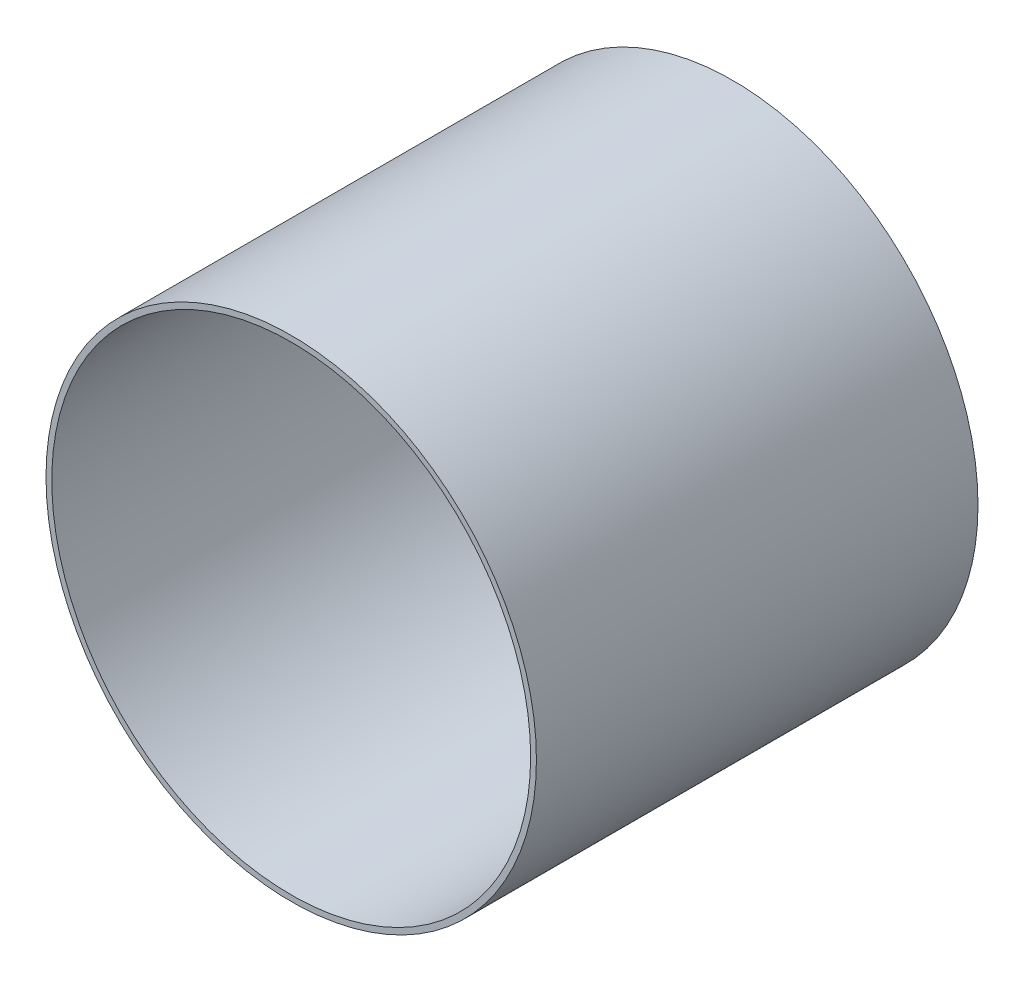
ISO-10303-21;
HEADER;
FILE_DESCRIPTION(('STEP AP214'),'2;1');
FILE_NAME('part.step','',(''),(''),'','','');
FILE_SCHEMA(('AUTOMOTIVE_DESIGN { 1 0 10303 214 1 1 1 1 }'));
ENDSEC;
DATA;
#1=APPLICATION_CONTEXT('core data for automotive mechanical design processes');
#2=APPLICATION_PROTOCOL_DEFINITION('international standard','automotive_design',2000,#1);
#3=PRODUCT_CONTEXT('',#1,'mechanical');
#4=PRODUCT('Part','Part','',(#3));
#5=PRODUCT_RELATED_PRODUCT_CATEGORY('part','',(#4));
#6=PRODUCT_DEFINITION_FORMATION('','',#4);
#7=PRODUCT_DEFINITION_CONTEXT('part definition',#1,'design');
#8=PRODUCT_DEFINITION('design','',#6,#7);
#9=PRODUCT_DEFINITION_SHAPE('','',#8);
#10=(LENGTH_UNIT() NAMED_UNIT(*) SI_UNIT(.MILLI.,.METRE.));
#11=(NAMED_UNIT(*) PLANE_ANGLE_UNIT() SI_UNIT($,.RADIAN.));
#12=(NAMED_UNIT(*) SI_UNIT($,.STERADIAN.) SOLID_ANGLE_UNIT());
#13=UNCERTAINTY_MEASURE_WITH_UNIT(LENGTH_MEASURE(1.E-05),#10,'distance_accuracy_value','');
#14=(GEOMETRIC_REPRESENTATION_CONTEXT(3) GLOBAL_UNCERTAINTY_ASSIGNED_CONTEXT((#13)) GLOBAL_UNIT_ASSIGNED_CONTEXT((#10,
#11,#12)) REPRESENTATION_CONTEXT('',''));
#15=CARTESIAN_POINT('',(0.,0.,0.));
#16=DIRECTION('',(0.,0.,1.));
#17=DIRECTION('',(1.,0.,0.));
#18=AXIS2_PLACEMENT_3D('',#15,#16,#17);
#19=CARTESIAN_POINT('',(0.,0.,57.15));
#20=DIRECTION('',(0.,0.,1.));
#21=DIRECTION('',(1.,0.,0.));
#22=AXIS2_PLACEMENT_3D('',#19,#20,#21);
#23=PLANE('',#22);
#24=CARTESIAN_POINT('',(0.,0.,57.15));
#25=DIRECTION('',(0.,0.,1.));
#26=DIRECTION('',(1.,0.,0.));
#27=AXIS2_PLACEMENT_3D('',#24,#25,#26);
#28=CIRCLE('',#27,63.4746);
#29=CARTESIAN_POINT('',(63.4746,0.,57.15));
#30=VERTEX_POINT('',#29);
#31=EDGE_CURVE('E10',#30,#30,#28,.T.);
#32=ORIENTED_EDGE('',*,*,#31,.T.);
#33=EDGE_LOOP('',(#32));
#34=FACE_BOUND('',#33,.T.);
#35=CARTESIAN_POINT('',(0.,0.,57.15));
#36=DIRECTION('',(0.,0.,1.));
#37=DIRECTION('',(1.,0.,0.));
#38=AXIS2_PLACEMENT_3D('',#35,#36,#37);
#39=CIRCLE('',#38,61.976);
#40=CARTESIAN_POINT('',(61.976,0.,57.15));
#41=VERTEX_POINT('',#40);
#42=EDGE_CURVE('E54',#41,#41,#39,.T.);
#43=ORIENTED_EDGE('',*,*,#42,.F.);
#44=EDGE_LOOP('',(#43));
#45=FACE_BOUND('',#44,.T.);
#46=ADVANCED_FACE('F43',(#34,#45),#23,.T.);
#47=CARTESIAN_POINT('',(0.,0.,-57.15));
#48=DIRECTION('',(0.,0.,1.));
#49=DIRECTION('',(1.,0.,0.));
#50=AXIS2_PLACEMENT_3D('',#47,#48,#49);
#51=PLANE('',#50);
#52=CARTESIAN_POINT('',(0.,0.,-57.15));
#53=DIRECTION('',(0.,0.,1.));
#54=DIRECTION('',(1.,0.,0.));
#55=AXIS2_PLACEMENT_3D('',#52,#53,#54);
#56=CIRCLE('',#55,63.4746);
#57=CARTESIAN_POINT('',(63.4746,0.,-57.15));
#58=VERTEX_POINT('',#57);
#59=EDGE_CURVE('E47',#58,#58,#56,.T.);
#60=ORIENTED_EDGE('',*,*,#59,.F.);
#61=EDGE_LOOP('',(#60));
#62=FACE_BOUND('',#61,.T.);
#63=CARTESIAN_POINT('',(0.,0.,-57.15));
#64=DIRECTION('',(0.,0.,1.));
#65=DIRECTION('',(1.,0.,0.));
#66=AXIS2_PLACEMENT_3D('',#63,#64,#65);
#67=CIRCLE('',#66,61.976);
#68=CARTESIAN_POINT('',(61.976,0.,-57.15));
#69=VERTEX_POINT('',#68);
#70=EDGE_CURVE('E56',#69,#69,#67,.T.);
#71=ORIENTED_EDGE('',*,*,#70,.T.);
#72=EDGE_LOOP('',(#71));
#73=FACE_BOUND('',#72,.T.);
#74=ADVANCED_FACE('F66',(#62,#73),#51,.F.);
#75=CARTESIAN_POINT('',(0.,0.,57.15));
#76=DIRECTION('',(0.,0.,-1.));
#77=DIRECTION('',(-1.,0.,0.));
#78=AXIS2_PLACEMENT_3D('',#75,#76,#77);
#79=CYLINDRICAL_SURFACE('',#78,63.4746);
#80=ORIENTED_EDGE('',*,*,#31,.F.);
#81=EDGE_LOOP('',(#80));
#82=FACE_BOUND('',#81,.T.);
#83=ORIENTED_EDGE('',*,*,#59,.T.);
#84=EDGE_LOOP('',(#83));
#85=FACE_BOUND('',#84,.T.);
#86=ADVANCED_FACE('F45',(#82,#85),#79,.T.);
#87=CARTESIAN_POINT('',(0.,0.,57.15));
#88=DIRECTION('',(0.,0.,-1.));
#89=DIRECTION('',(-1.,0.,0.));
#90=AXIS2_PLACEMENT_3D('',#87,#88,#89);
#91=CYLINDRICAL_SURFACE('',#90,61.976);
#92=ORIENTED_EDGE('',*,*,#42,.T.);
#93=EDGE_LOOP('',(#92));
#94=FACE_BOUND('',#93,.T.);
#95=ORIENTED_EDGE('',*,*,#70,.F.);
#96=EDGE_LOOP('',(#95));
#97=FACE_BOUND('',#96,.T.);
#98=ADVANCED_FACE('F62',(#94,#97),#91,.F.);
#99=CLOSED_SHELL('',(#46,#74,#86,#98));
#100=MANIFOLD_SOLID_BREP('B2',#99);
#101=ADVANCED_BREP_SHAPE_REPRESENTATION('',(#18,#100),#14);
#102=SHAPE_DEFINITION_REPRESENTATION(#9,#101);
ENDSEC;
END-ISO-10303-21;
